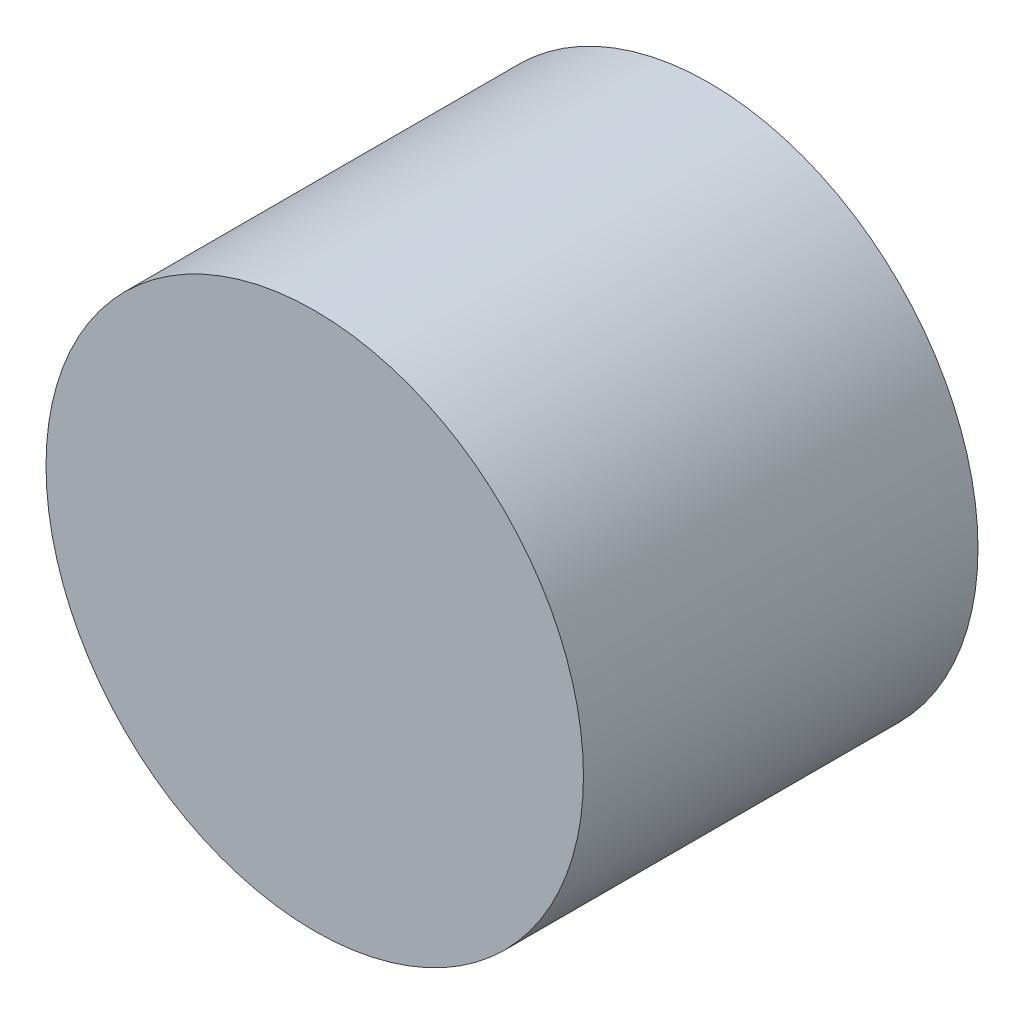
ISO-10303-21;
HEADER;
FILE_DESCRIPTION(('STEP AP214'),'2;1');
FILE_NAME('part.step','',(''),(''),'','','');
FILE_SCHEMA(('AUTOMOTIVE_DESIGN { 1 0 10303 214 1 1 1 1 }'));
ENDSEC;
DATA;
#1=APPLICATION_CONTEXT('core data for automotive mechanical design processes');
#2=APPLICATION_PROTOCOL_DEFINITION('international standard','automotive_design',2000,#1);
#3=PRODUCT_CONTEXT('',#1,'mechanical');
#4=PRODUCT('Part','Part','',(#3));
#5=PRODUCT_RELATED_PRODUCT_CATEGORY('part','',(#4));
#6=PRODUCT_DEFINITION_FORMATION('','',#4);
#7=PRODUCT_DEFINITION_CONTEXT('part definition',#1,'design');
#8=PRODUCT_DEFINITION('design','',#6,#7);
#9=PRODUCT_DEFINITION_SHAPE('','',#8);
#10=(LENGTH_UNIT() NAMED_UNIT(*) SI_UNIT(.MILLI.,.METRE.));
#11=(NAMED_UNIT(*) PLANE_ANGLE_UNIT() SI_UNIT($,.RADIAN.));
#12=(NAMED_UNIT(*) SI_UNIT($,.STERADIAN.) SOLID_ANGLE_UNIT());
#13=UNCERTAINTY_MEASURE_WITH_UNIT(LENGTH_MEASURE(1.E-05),#10,'distance_accuracy_value','');
#14=(GEOMETRIC_REPRESENTATION_CONTEXT(3) GLOBAL_UNCERTAINTY_ASSIGNED_CONTEXT((#13)) GLOBAL_UNIT_ASSIGNED_CONTEXT((#10,
#11,#12)) REPRESENTATION_CONTEXT('',''));
#15=CARTESIAN_POINT('',(0.,0.,0.));
#16=DIRECTION('',(0.,0.,1.));
#17=DIRECTION('',(1.,0.,0.));
#18=AXIS2_PLACEMENT_3D('',#15,#16,#17);
#19=CARTESIAN_POINT('',(4.29775761705287,0.,-5.85318000435777));
#20=DIRECTION('',(0.,0.,1.));
#21=DIRECTION('',(1.,0.,0.));
#22=AXIS2_PLACEMENT_3D('',#19,#20,#21);
#23=CYLINDRICAL_SURFACE('',#22,1.3623048551069);
#24=CARTESIAN_POINT('',(4.29775761705287,0.,-2.));
#25=DIRECTION('',(0.,0.,1.));
#26=DIRECTION('',(1.,0.,0.));
#27=AXIS2_PLACEMENT_3D('',#24,#25,#26);
#28=CIRCLE('',#27,1.3623048551069);
#29=CARTESIAN_POINT('',(5.66006247215976,0.,-2.));
#30=VERTEX_POINT('',#29);
#31=EDGE_CURVE('E10',#30,#30,#28,.F.);
#32=ORIENTED_EDGE('',*,*,#31,.F.);
#33=EDGE_LOOP('',(#32));
#34=FACE_BOUND('',#33,.T.);
#35=CARTESIAN_POINT('',(4.29775761705287,0.,0.));
#36=DIRECTION('',(0.,0.,1.));
#37=DIRECTION('',(1.,0.,0.));
#38=AXIS2_PLACEMENT_3D('',#35,#36,#37);
#39=CIRCLE('',#38,1.3623048551069);
#40=CARTESIAN_POINT('',(5.66006247215976,0.,0.));
#41=VERTEX_POINT('',#40);
#42=EDGE_CURVE('E39',#41,#41,#39,.T.);
#43=ORIENTED_EDGE('',*,*,#42,.F.);
#44=EDGE_LOOP('',(#43));
#45=FACE_BOUND('',#44,.T.);
#46=ADVANCED_FACE('F33',(#34,#45),#23,.T.);
#47=CARTESIAN_POINT('',(4.29775761705287,0.,0.));
#48=DIRECTION('',(0.,0.,1.));
#49=DIRECTION('',(1.,0.,0.));
#50=AXIS2_PLACEMENT_3D('',#47,#48,#49);
#51=PLANE('',#50);
#52=ORIENTED_EDGE('',*,*,#42,.T.);
#53=EDGE_LOOP('',(#52));
#54=FACE_BOUND('',#53,.T.);
#55=ADVANCED_FACE('F45',(#54),#51,.T.);
#56=CARTESIAN_POINT('',(0.,0.,-2.));
#57=DIRECTION('',(0.,0.,1.));
#58=DIRECTION('',(0.,-1.,0.));
#59=AXIS2_PLACEMENT_3D('',#56,#57,#58);
#60=PLANE('',#59);
#61=ORIENTED_EDGE('',*,*,#31,.T.);
#62=EDGE_LOOP('',(#61));
#63=FACE_BOUND('',#62,.T.);
#64=ADVANCED_FACE('F52',(#63),#60,.F.);
#65=CLOSED_SHELL('',(#46,#55,#64));
#66=MANIFOLD_SOLID_BREP('B2',#65);
#67=ADVANCED_BREP_SHAPE_REPRESENTATION('',(#18,#66),#14);
#68=SHAPE_DEFINITION_REPRESENTATION(#9,#67);
ENDSEC;
END-ISO-10303-21;
